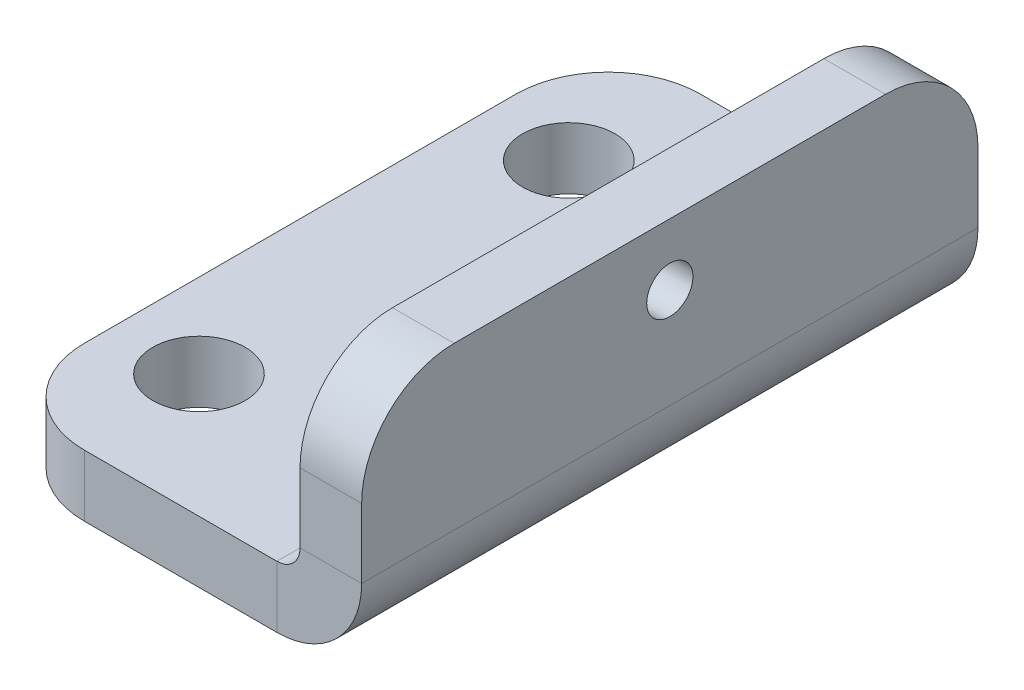
ISO-10303-21;
HEADER;
FILE_DESCRIPTION(('STEP AP214'),'2;1');
FILE_NAME('part.step','',(''),(''),'','','');
FILE_SCHEMA(('AUTOMOTIVE_DESIGN { 1 0 10303 214 1 1 1 1 }'));
ENDSEC;
DATA;
#1=APPLICATION_CONTEXT('core data for automotive mechanical design processes');
#2=APPLICATION_PROTOCOL_DEFINITION('international standard','automotive_design',2000,#1);
#3=PRODUCT_CONTEXT('',#1,'mechanical');
#4=PRODUCT('Part','Part','',(#3));
#5=PRODUCT_RELATED_PRODUCT_CATEGORY('part','',(#4));
#6=PRODUCT_DEFINITION_FORMATION('','',#4);
#7=PRODUCT_DEFINITION_CONTEXT('part definition',#1,'design');
#8=PRODUCT_DEFINITION('design','',#6,#7);
#9=PRODUCT_DEFINITION_SHAPE('','',#8);
#10=(LENGTH_UNIT() NAMED_UNIT(*) SI_UNIT(.MILLI.,.METRE.));
#11=(NAMED_UNIT(*) PLANE_ANGLE_UNIT() SI_UNIT($,.RADIAN.));
#12=(NAMED_UNIT(*) SI_UNIT($,.STERADIAN.) SOLID_ANGLE_UNIT());
#13=UNCERTAINTY_MEASURE_WITH_UNIT(LENGTH_MEASURE(1.E-05),#10,'distance_accuracy_value','');
#14=(GEOMETRIC_REPRESENTATION_CONTEXT(3) GLOBAL_UNCERTAINTY_ASSIGNED_CONTEXT((#13)) GLOBAL_UNIT_ASSIGNED_CONTEXT((#10,
#11,#12)) REPRESENTATION_CONTEXT('',''));
#15=CARTESIAN_POINT('',(0.,0.,0.));
#16=DIRECTION('',(0.,0.,1.));
#17=DIRECTION('',(1.,0.,0.));
#18=AXIS2_PLACEMENT_3D('',#15,#16,#17);
#19=CARTESIAN_POINT('',(-2.75,0.,10.));
#20=DIRECTION('',(0.,0.,1.));
#21=DIRECTION('',(1.,0.,0.));
#22=AXIS2_PLACEMENT_3D('',#19,#20,#21);
#23=PLANE('',#22);
#24=DIRECTION('',(0.,1.,0.));
#25=VECTOR('',#24,1.);
#26=CARTESIAN_POINT('',(-2.75,0.,10.));
#27=LINE('',#26,#25);
#28=CARTESIAN_POINT('',(-2.75,0.,10.));
#29=VERTEX_POINT('',#28);
#30=CARTESIAN_POINT('',(-2.75,2.,10.));
#31=VERTEX_POINT('',#30);
#32=EDGE_CURVE('E125',#29,#31,#27,.T.);
#33=ORIENTED_EDGE('',*,*,#32,.F.);
#34=CARTESIAN_POINT('',(-2.75,2.75,10.));
#35=DIRECTION('',(0.,0.,1.));
#36=DIRECTION('',(1.,0.,0.));
#37=AXIS2_PLACEMENT_3D('',#34,#35,#36);
#38=CIRCLE('',#37,2.75);
#39=CARTESIAN_POINT('',(0.,2.75,10.));
#40=VERTEX_POINT('',#39);
#41=EDGE_CURVE('E129',#40,#29,#38,.F.);
#42=ORIENTED_EDGE('',*,*,#41,.F.);
#43=DIRECTION('',(1.,0.,0.));
#44=VECTOR('',#43,1.);
#45=CARTESIAN_POINT('',(-2.,2.75,10.));
#46=LINE('',#45,#44);
#47=CARTESIAN_POINT('',(-2.,2.75,10.));
#48=VERTEX_POINT('',#47);
#49=EDGE_CURVE('E134',#48,#40,#46,.T.);
#50=ORIENTED_EDGE('',*,*,#49,.F.);
#51=CARTESIAN_POINT('',(-2.75,2.75,10.));
#52=DIRECTION('',(0.,0.,1.));
#53=DIRECTION('',(1.,0.,0.));
#54=AXIS2_PLACEMENT_3D('',#51,#52,#53);
#55=CIRCLE('',#54,0.75);
#56=EDGE_CURVE('E131',#48,#31,#55,.F.);
#57=ORIENTED_EDGE('',*,*,#56,.T.);
#58=EDGE_LOOP('',(#33,#42,#50,#57));
#59=FACE_BOUND('',#58,.T.);
#60=ADVANCED_FACE('F34',(#59),#23,.T.);
#61=CARTESIAN_POINT('',(-2.,2.75,10.));
#62=DIRECTION('',(0.,0.,1.));
#63=DIRECTION('',(1.,0.,0.));
#64=AXIS2_PLACEMENT_3D('',#61,#62,#63);
#65=PLANE('',#64);
#66=DIRECTION('',(-1.,0.,0.));
#67=VECTOR('',#66,1.);
#68=CARTESIAN_POINT('',(0.,2.,10.));
#69=LINE('',#68,#67);
#70=CARTESIAN_POINT('',(-9.,2.,10.));
#71=VERTEX_POINT('',#70);
#72=EDGE_CURVE('E152',#31,#71,#69,.T.);
#73=ORIENTED_EDGE('',*,*,#72,.T.);
#74=DIRECTION('',(0.,1.,0.));
#75=VECTOR('',#74,1.);
#76=CARTESIAN_POINT('',(-9.,2.75,10.));
#77=LINE('',#76,#75);
#78=CARTESIAN_POINT('',(-9.,0.,10.));
#79=VERTEX_POINT('',#78);
#80=EDGE_CURVE('E42',#71,#79,#77,.F.);
#81=ORIENTED_EDGE('',*,*,#80,.T.);
#82=DIRECTION('',(-1.,0.,0.));
#83=VECTOR('',#82,1.);
#84=CARTESIAN_POINT('',(0.,0.,10.));
#85=LINE('',#84,#83);
#86=EDGE_CURVE('E141',#29,#79,#85,.T.);
#87=ORIENTED_EDGE('',*,*,#86,.F.);
#88=ORIENTED_EDGE('',*,*,#32,.T.);
#89=EDGE_LOOP('',(#73,#81,#87,#88));
#90=FACE_BOUND('',#89,.T.);
#91=ADVANCED_FACE('F151',(#90),#65,.T.);
#92=CARTESIAN_POINT('',(0.,2.75,-10.));
#93=DIRECTION('',(0.,0.,-1.));
#94=DIRECTION('',(-1.,0.,0.));
#95=AXIS2_PLACEMENT_3D('',#92,#93,#94);
#96=PLANE('',#95);
#97=DIRECTION('',(-1.,0.,0.));
#98=VECTOR('',#97,1.);
#99=CARTESIAN_POINT('',(0.,2.75,-10.));
#100=LINE('',#99,#98);
#101=CARTESIAN_POINT('',(0.,2.75,-10.));
#102=VERTEX_POINT('',#101);
#103=CARTESIAN_POINT('',(-2.,2.75,-10.));
#104=VERTEX_POINT('',#103);
#105=EDGE_CURVE('E197',#102,#104,#100,.T.);
#106=ORIENTED_EDGE('',*,*,#105,.F.);
#107=CARTESIAN_POINT('',(-2.75,2.75,-10.));
#108=DIRECTION('',(0.,0.,1.));
#109=DIRECTION('',(1.,0.,0.));
#110=AXIS2_PLACEMENT_3D('',#107,#108,#109);
#111=CIRCLE('',#110,2.75);
#112=CARTESIAN_POINT('',(-2.75,0.,-10.));
#113=VERTEX_POINT('',#112);
#114=EDGE_CURVE('E171',#102,#113,#111,.F.);
#115=ORIENTED_EDGE('',*,*,#114,.T.);
#116=DIRECTION('',(0.,-1.,0.));
#117=VECTOR('',#116,1.);
#118=CARTESIAN_POINT('',(-2.75,2.,-10.));
#119=LINE('',#118,#117);
#120=CARTESIAN_POINT('',(-2.75,2.,-10.));
#121=VERTEX_POINT('',#120);
#122=EDGE_CURVE('E195',#121,#113,#119,.T.);
#123=ORIENTED_EDGE('',*,*,#122,.F.);
#124=CARTESIAN_POINT('',(-2.75,2.75,-10.));
#125=DIRECTION('',(0.,0.,1.));
#126=DIRECTION('',(1.,0.,0.));
#127=AXIS2_PLACEMENT_3D('',#124,#125,#126);
#128=CIRCLE('',#127,0.75);
#129=EDGE_CURVE('E177',#104,#121,#128,.F.);
#130=ORIENTED_EDGE('',*,*,#129,.F.);
#131=EDGE_LOOP('',(#106,#115,#123,#130));
#132=FACE_BOUND('',#131,.T.);
#133=ADVANCED_FACE('F299',(#132),#96,.T.);
#134=CARTESIAN_POINT('',(-2.75,2.,-10.));
#135=DIRECTION('',(0.,0.,-1.));
#136=DIRECTION('',(-1.,0.,0.));
#137=AXIS2_PLACEMENT_3D('',#134,#135,#136);
#138=PLANE('',#137);
#139=DIRECTION('',(0.,1.,0.));
#140=VECTOR('',#139,1.);
#141=CARTESIAN_POINT('',(-2.,8.,-10.));
#142=LINE('',#141,#140);
#143=CARTESIAN_POINT('',(-2.,5.,-10.));
#144=VERTEX_POINT('',#143);
#145=EDGE_CURVE('E175',#144,#104,#142,.F.);
#146=ORIENTED_EDGE('',*,*,#145,.F.);
#147=DIRECTION('',(1.,0.,0.));
#148=VECTOR('',#147,1.);
#149=CARTESIAN_POINT('',(-2.75,5.,-10.));
#150=LINE('',#149,#148);
#151=CARTESIAN_POINT('',(0.,5.,-10.));
#152=VERTEX_POINT('',#151);
#153=EDGE_CURVE('E133',#144,#152,#150,.T.);
#154=ORIENTED_EDGE('',*,*,#153,.T.);
#155=DIRECTION('',(0.,-1.,0.));
#156=VECTOR('',#155,1.);
#157=CARTESIAN_POINT('',(0.,8.,-10.));
#158=LINE('',#157,#156);
#159=EDGE_CURVE('E173',#152,#102,#158,.T.);
#160=ORIENTED_EDGE('',*,*,#159,.T.);
#161=ORIENTED_EDGE('',*,*,#105,.T.);
#162=EDGE_LOOP('',(#146,#154,#160,#161));
#163=FACE_BOUND('',#162,.T.);
#164=ADVANCED_FACE('F294',(#163),#138,.T.);
#165=CARTESIAN_POINT('',(0.,2.,10.));
#166=DIRECTION('',(0.,-1.,0.));
#167=DIRECTION('',(1.,0.,0.));
#168=AXIS2_PLACEMENT_3D('',#165,#166,#167);
#169=PLANE('',#168);
#170=CARTESIAN_POINT('',(-9.27896890843565,2.,6.));
#171=DIRECTION('',(0.,1.,0.));
#172=DIRECTION('',(1.,0.,0.));
#173=AXIS2_PLACEMENT_3D('',#170,#171,#172);
#174=CIRCLE('',#173,1.5);
#175=CARTESIAN_POINT('',(-7.77896890843565,2.,6.));
#176=VERTEX_POINT('',#175);
#177=EDGE_CURVE('E253',#176,#176,#174,.T.);
#178=ORIENTED_EDGE('',*,*,#177,.F.);
#179=EDGE_LOOP('',(#178));
#180=FACE_BOUND('',#179,.T.);
#181=CARTESIAN_POINT('',(-9.27896890843565,2.,-6.));
#182=DIRECTION('',(0.,1.,0.));
#183=DIRECTION('',(-1.,0.,0.));
#184=AXIS2_PLACEMENT_3D('',#181,#182,#183);
#185=CIRCLE('',#184,1.5);
#186=CARTESIAN_POINT('',(-10.7789689084356,2.,-6.));
#187=VERTEX_POINT('',#186);
#188=EDGE_CURVE('E247',#187,#187,#185,.T.);
#189=ORIENTED_EDGE('',*,*,#188,.F.);
#190=EDGE_LOOP('',(#189));
#191=FACE_BOUND('',#190,.T.);
#192=DIRECTION('',(-1.,0.,0.));
#193=VECTOR('',#192,1.);
#194=CARTESIAN_POINT('',(0.,2.,-10.));
#195=LINE('',#194,#193);
#196=CARTESIAN_POINT('',(-9.,2.,-10.));
#197=VERTEX_POINT('',#196);
#198=EDGE_CURVE('E166',#121,#197,#195,.T.);
#199=ORIENTED_EDGE('',*,*,#198,.T.);
#200=CARTESIAN_POINT('',(-9.,2.,-7.));
#201=DIRECTION('',(0.,-1.,0.));
#202=DIRECTION('',(1.,0.,0.));
#203=AXIS2_PLACEMENT_3D('',#200,#201,#202);
#204=CIRCLE('',#203,3.);
#205=CARTESIAN_POINT('',(-12.,2.,-7.));
#206=VERTEX_POINT('',#205);
#207=EDGE_CURVE('E222',#197,#206,#204,.F.);
#208=ORIENTED_EDGE('',*,*,#207,.T.);
#209=DIRECTION('',(0.,0.,-1.));
#210=VECTOR('',#209,1.);
#211=CARTESIAN_POINT('',(-12.,2.,10.));
#212=LINE('',#211,#210);
#213=CARTESIAN_POINT('',(-12.,2.,7.));
#214=VERTEX_POINT('',#213);
#215=EDGE_CURVE('E193',#214,#206,#212,.T.);
#216=ORIENTED_EDGE('',*,*,#215,.F.);
#217=CARTESIAN_POINT('',(-9.,2.,7.));
#218=DIRECTION('',(0.,-1.,0.));
#219=DIRECTION('',(1.,0.,0.));
#220=AXIS2_PLACEMENT_3D('',#217,#218,#219);
#221=CIRCLE('',#220,3.);
#222=EDGE_CURVE('E220',#214,#71,#221,.F.);
#223=ORIENTED_EDGE('',*,*,#222,.T.);
#224=ORIENTED_EDGE('',*,*,#72,.F.);
#225=DIRECTION('',(0.,0.,-1.));
#226=VECTOR('',#225,1.);
#227=CARTESIAN_POINT('',(-2.75,2.,10.));
#228=LINE('',#227,#226);
#229=EDGE_CURVE('E165',#31,#121,#228,.T.);
#230=ORIENTED_EDGE('',*,*,#229,.T.);
#231=EDGE_LOOP('',(#199,#208,#216,#223,#224,#230));
#232=FACE_BOUND('',#231,.T.);
#233=ADVANCED_FACE('F240',(#180,#191,#232),#169,.F.);
#234=CARTESIAN_POINT('',(-12.,0.,10.));
#235=DIRECTION('',(-1.,0.,0.));
#236=DIRECTION('',(0.,0.,1.));
#237=AXIS2_PLACEMENT_3D('',#234,#235,#236);
#238=PLANE('',#237);
#239=ORIENTED_EDGE('',*,*,#215,.T.);
#240=DIRECTION('',(0.,1.,0.));
#241=VECTOR('',#240,1.);
#242=CARTESIAN_POINT('',(-12.,0.,-7.));
#243=LINE('',#242,#241);
#244=CARTESIAN_POINT('',(-12.,0.,-7.));
#245=VERTEX_POINT('',#244);
#246=EDGE_CURVE('E56',#206,#245,#243,.F.);
#247=ORIENTED_EDGE('',*,*,#246,.T.);
#248=DIRECTION('',(0.,0.,-1.));
#249=VECTOR('',#248,1.);
#250=CARTESIAN_POINT('',(-12.,0.,10.));
#251=LINE('',#250,#249);
#252=CARTESIAN_POINT('',(-12.,0.,7.));
#253=VERTEX_POINT('',#252);
#254=EDGE_CURVE('E148',#253,#245,#251,.T.);
#255=ORIENTED_EDGE('',*,*,#254,.F.);
#256=DIRECTION('',(0.,1.,0.));
#257=VECTOR('',#256,1.);
#258=CARTESIAN_POINT('',(-12.,0.,7.));
#259=LINE('',#258,#257);
#260=EDGE_CURVE('E224',#253,#214,#259,.T.);
#261=ORIENTED_EDGE('',*,*,#260,.T.);
#262=EDGE_LOOP('',(#239,#247,#255,#261));
#263=FACE_BOUND('',#262,.T.);
#264=ADVANCED_FACE('F241',(#263),#238,.T.);
#265=CARTESIAN_POINT('',(0.,0.,10.));
#266=DIRECTION('',(0.,-1.,0.));
#267=DIRECTION('',(1.,0.,0.));
#268=AXIS2_PLACEMENT_3D('',#265,#266,#267);
#269=PLANE('',#268);
#270=CARTESIAN_POINT('',(-9.27896890843565,0.,6.));
#271=DIRECTION('',(0.,1.,0.));
#272=DIRECTION('',(1.,0.,0.));
#273=AXIS2_PLACEMENT_3D('',#270,#271,#272);
#274=CIRCLE('',#273,1.5);
#275=CARTESIAN_POINT('',(-7.77896890843565,0.,6.));
#276=VERTEX_POINT('',#275);
#277=EDGE_CURVE('E250',#276,#276,#274,.T.);
#278=ORIENTED_EDGE('',*,*,#277,.T.);
#279=EDGE_LOOP('',(#278));
#280=FACE_BOUND('',#279,.T.);
#281=CARTESIAN_POINT('',(-9.27896890843565,0.,-6.));
#282=DIRECTION('',(0.,1.,0.));
#283=DIRECTION('',(-1.,0.,0.));
#284=AXIS2_PLACEMENT_3D('',#281,#282,#283);
#285=CIRCLE('',#284,1.5);
#286=CARTESIAN_POINT('',(-10.7789689084356,0.,-6.));
#287=VERTEX_POINT('',#286);
#288=EDGE_CURVE('E169',#287,#287,#285,.T.);
#289=ORIENTED_EDGE('',*,*,#288,.T.);
#290=EDGE_LOOP('',(#289));
#291=FACE_BOUND('',#290,.T.);
#292=ORIENTED_EDGE('',*,*,#254,.T.);
#293=CARTESIAN_POINT('',(-9.,0.,-7.));
#294=DIRECTION('',(0.,-1.,0.));
#295=DIRECTION('',(1.,0.,0.));
#296=AXIS2_PLACEMENT_3D('',#293,#294,#295);
#297=CIRCLE('',#296,3.);
#298=CARTESIAN_POINT('',(-9.,0.,-10.));
#299=VERTEX_POINT('',#298);
#300=EDGE_CURVE('E230',#245,#299,#297,.T.);
#301=ORIENTED_EDGE('',*,*,#300,.T.);
#302=DIRECTION('',(-1.,0.,0.));
#303=VECTOR('',#302,1.);
#304=CARTESIAN_POINT('',(0.,0.,-10.));
#305=LINE('',#304,#303);
#306=EDGE_CURVE('E144',#113,#299,#305,.T.);
#307=ORIENTED_EDGE('',*,*,#306,.F.);
#308=DIRECTION('',(0.,0.,-1.));
#309=VECTOR('',#308,1.);
#310=CARTESIAN_POINT('',(-2.75,0.,10.));
#311=LINE('',#310,#309);
#312=EDGE_CURVE('E139',#29,#113,#311,.T.);
#313=ORIENTED_EDGE('',*,*,#312,.F.);
#314=ORIENTED_EDGE('',*,*,#86,.T.);
#315=CARTESIAN_POINT('',(-9.,0.,7.));
#316=DIRECTION('',(0.,-1.,0.));
#317=DIRECTION('',(1.,0.,0.));
#318=AXIS2_PLACEMENT_3D('',#315,#316,#317);
#319=CIRCLE('',#318,3.);
#320=EDGE_CURVE('E228',#79,#253,#319,.T.);
#321=ORIENTED_EDGE('',*,*,#320,.T.);
#322=EDGE_LOOP('',(#292,#301,#307,#313,#314,#321));
#323=FACE_BOUND('',#322,.T.);
#324=ADVANCED_FACE('F140',(#280,#291,#323),#269,.T.);
#325=CARTESIAN_POINT('',(-2.75,2.75,10.));
#326=DIRECTION('',(0.,0.,-1.));
#327=DIRECTION('',(-1.,0.,0.));
#328=AXIS2_PLACEMENT_3D('',#325,#326,#327);
#329=CYLINDRICAL_SURFACE('',#328,2.75);
#330=ORIENTED_EDGE('',*,*,#114,.F.);
#331=DIRECTION('',(0.,0.,-1.));
#332=VECTOR('',#331,1.);
#333=CARTESIAN_POINT('',(0.,2.75,10.));
#334=LINE('',#333,#332);
#335=EDGE_CURVE('E149',#40,#102,#334,.T.);
#336=ORIENTED_EDGE('',*,*,#335,.F.);
#337=ORIENTED_EDGE('',*,*,#41,.T.);
#338=ORIENTED_EDGE('',*,*,#312,.T.);
#339=EDGE_LOOP('',(#330,#336,#337,#338));
#340=FACE_BOUND('',#339,.T.);
#341=ADVANCED_FACE('F155',(#340),#329,.T.);
#342=CARTESIAN_POINT('',(0.,8.,10.));
#343=DIRECTION('',(1.,0.,0.));
#344=DIRECTION('',(0.,0.,-1.));
#345=AXIS2_PLACEMENT_3D('',#342,#343,#344);
#346=PLANE('',#345);
#347=CARTESIAN_POINT('',(0.,6.,0.));
#348=DIRECTION('',(-1.,0.,0.));
#349=DIRECTION('',(0.,0.,1.));
#350=AXIS2_PLACEMENT_3D('',#347,#348,#349);
#351=CIRCLE('',#350,0.75);
#352=CARTESIAN_POINT('',(0.,6.,0.75));
#353=VERTEX_POINT('',#352);
#354=EDGE_CURVE('E256',#353,#353,#351,.T.);
#355=ORIENTED_EDGE('',*,*,#354,.T.);
#356=EDGE_LOOP('',(#355));
#357=FACE_BOUND('',#356,.T.);
#358=ORIENTED_EDGE('',*,*,#159,.F.);
#359=CARTESIAN_POINT('',(0.,5.,-7.));
#360=DIRECTION('',(1.,0.,0.));
#361=DIRECTION('',(0.,0.,-1.));
#362=AXIS2_PLACEMENT_3D('',#359,#360,#361);
#363=CIRCLE('',#362,3.);
#364=CARTESIAN_POINT('',(0.,8.,-7.));
#365=VERTEX_POINT('',#364);
#366=EDGE_CURVE('E206',#152,#365,#363,.T.);
#367=ORIENTED_EDGE('',*,*,#366,.T.);
#368=DIRECTION('',(0.,0.,-1.));
#369=VECTOR('',#368,1.);
#370=CARTESIAN_POINT('',(0.,8.,10.));
#371=LINE('',#370,#369);
#372=CARTESIAN_POINT('',(0.,8.,7.));
#373=VERTEX_POINT('',#372);
#374=EDGE_CURVE('E188',#373,#365,#371,.T.);
#375=ORIENTED_EDGE('',*,*,#374,.F.);
#376=CARTESIAN_POINT('',(0.,5.,7.));
#377=DIRECTION('',(1.,0.,0.));
#378=DIRECTION('',(0.,0.,-1.));
#379=AXIS2_PLACEMENT_3D('',#376,#377,#378);
#380=CIRCLE('',#379,3.);
#381=CARTESIAN_POINT('',(0.,5.,10.));
#382=VERTEX_POINT('',#381);
#383=EDGE_CURVE('E204',#373,#382,#380,.T.);
#384=ORIENTED_EDGE('',*,*,#383,.T.);
#385=DIRECTION('',(0.,-1.,0.));
#386=VECTOR('',#385,1.);
#387=CARTESIAN_POINT('',(0.,8.,10.));
#388=LINE('',#387,#386);
#389=EDGE_CURVE('E157',#382,#40,#388,.T.);
#390=ORIENTED_EDGE('',*,*,#389,.T.);
#391=ORIENTED_EDGE('',*,*,#335,.T.);
#392=EDGE_LOOP('',(#358,#367,#375,#384,#390,#391));
#393=FACE_BOUND('',#392,.T.);
#394=ADVANCED_FACE('F265',(#357,#393),#346,.T.);
#395=CARTESIAN_POINT('',(-2.,8.,10.));
#396=DIRECTION('',(0.,1.,0.));
#397=DIRECTION('',(0.,0.,1.));
#398=AXIS2_PLACEMENT_3D('',#395,#396,#397);
#399=PLANE('',#398);
#400=ORIENTED_EDGE('',*,*,#374,.T.);
#401=DIRECTION('',(1.,0.,0.));
#402=VECTOR('',#401,1.);
#403=CARTESIAN_POINT('',(-2.,8.,-7.));
#404=LINE('',#403,#402);
#405=CARTESIAN_POINT('',(-2.,8.,-7.));
#406=VERTEX_POINT('',#405);
#407=EDGE_CURVE('E211',#365,#406,#404,.F.);
#408=ORIENTED_EDGE('',*,*,#407,.T.);
#409=DIRECTION('',(0.,0.,-1.));
#410=VECTOR('',#409,1.);
#411=CARTESIAN_POINT('',(-2.,8.,10.));
#412=LINE('',#411,#410);
#413=CARTESIAN_POINT('',(-2.,8.,7.));
#414=VERTEX_POINT('',#413);
#415=EDGE_CURVE('E185',#414,#406,#412,.T.);
#416=ORIENTED_EDGE('',*,*,#415,.F.);
#417=DIRECTION('',(1.,0.,0.));
#418=VECTOR('',#417,1.);
#419=CARTESIAN_POINT('',(-2.,8.,7.));
#420=LINE('',#419,#418);
#421=EDGE_CURVE('E208',#414,#373,#420,.T.);
#422=ORIENTED_EDGE('',*,*,#421,.T.);
#423=EDGE_LOOP('',(#400,#408,#416,#422));
#424=FACE_BOUND('',#423,.T.);
#425=ADVANCED_FACE('F279',(#424),#399,.T.);
#426=CARTESIAN_POINT('',(-2.,8.,10.));
#427=DIRECTION('',(1.,0.,0.));
#428=DIRECTION('',(0.,0.,-1.));
#429=AXIS2_PLACEMENT_3D('',#426,#427,#428);
#430=PLANE('',#429);
#431=CARTESIAN_POINT('',(-2.,6.,0.));
#432=DIRECTION('',(-1.,0.,0.));
#433=DIRECTION('',(0.,0.,1.));
#434=AXIS2_PLACEMENT_3D('',#431,#432,#433);
#435=CIRCLE('',#434,0.75);
#436=CARTESIAN_POINT('',(-2.,6.,0.75));
#437=VERTEX_POINT('',#436);
#438=EDGE_CURVE('E259',#437,#437,#435,.T.);
#439=ORIENTED_EDGE('',*,*,#438,.F.);
#440=EDGE_LOOP('',(#439));
#441=FACE_BOUND('',#440,.T.);
#442=ORIENTED_EDGE('',*,*,#415,.T.);
#443=CARTESIAN_POINT('',(-2.,5.,-7.));
#444=DIRECTION('',(1.,0.,0.));
#445=DIRECTION('',(0.,0.,-1.));
#446=AXIS2_PLACEMENT_3D('',#443,#444,#445);
#447=CIRCLE('',#446,3.);
#448=EDGE_CURVE('E215',#406,#144,#447,.F.);
#449=ORIENTED_EDGE('',*,*,#448,.T.);
#450=ORIENTED_EDGE('',*,*,#145,.T.);
#451=DIRECTION('',(0.,0.,-1.));
#452=VECTOR('',#451,1.);
#453=CARTESIAN_POINT('',(-2.,2.75,10.));
#454=LINE('',#453,#452);
#455=EDGE_CURVE('E182',#48,#104,#454,.T.);
#456=ORIENTED_EDGE('',*,*,#455,.F.);
#457=DIRECTION('',(0.,1.,0.));
#458=VECTOR('',#457,1.);
#459=CARTESIAN_POINT('',(-2.,8.,10.));
#460=LINE('',#459,#458);
#461=CARTESIAN_POINT('',(-2.,5.,10.));
#462=VERTEX_POINT('',#461);
#463=EDGE_CURVE('E159',#462,#48,#460,.F.);
#464=ORIENTED_EDGE('',*,*,#463,.F.);
#465=CARTESIAN_POINT('',(-2.,5.,7.));
#466=DIRECTION('',(1.,0.,0.));
#467=DIRECTION('',(0.,0.,-1.));
#468=AXIS2_PLACEMENT_3D('',#465,#466,#467);
#469=CIRCLE('',#468,3.);
#470=EDGE_CURVE('E213',#462,#414,#469,.F.);
#471=ORIENTED_EDGE('',*,*,#470,.T.);
#472=EDGE_LOOP('',(#442,#449,#450,#456,#464,#471));
#473=FACE_BOUND('',#472,.T.);
#474=ADVANCED_FACE('F275',(#441,#473),#430,.F.);
#475=CARTESIAN_POINT('',(-2.75,2.75,10.));
#476=DIRECTION('',(0.,0.,-1.));
#477=DIRECTION('',(-1.,0.,0.));
#478=AXIS2_PLACEMENT_3D('',#475,#476,#477);
#479=CYLINDRICAL_SURFACE('',#478,0.75);
#480=ORIENTED_EDGE('',*,*,#129,.T.);
#481=ORIENTED_EDGE('',*,*,#229,.F.);
#482=ORIENTED_EDGE('',*,*,#56,.F.);
#483=ORIENTED_EDGE('',*,*,#455,.T.);
#484=EDGE_LOOP('',(#480,#481,#482,#483));
#485=FACE_BOUND('',#484,.T.);
#486=ADVANCED_FACE('F278',(#485),#479,.F.);
#487=CARTESIAN_POINT('',(-2.75,2.75,10.));
#488=DIRECTION('',(0.,0.,1.));
#489=DIRECTION('',(1.,0.,0.));
#490=AXIS2_PLACEMENT_3D('',#487,#488,#489);
#491=PLANE('',#490);
#492=ORIENTED_EDGE('',*,*,#389,.F.);
#493=DIRECTION('',(1.,0.,0.));
#494=VECTOR('',#493,1.);
#495=CARTESIAN_POINT('',(-2.75,5.,10.));
#496=LINE('',#495,#494);
#497=EDGE_CURVE('E11',#382,#462,#496,.F.);
#498=ORIENTED_EDGE('',*,*,#497,.T.);
#499=ORIENTED_EDGE('',*,*,#463,.T.);
#500=ORIENTED_EDGE('',*,*,#49,.T.);
#501=EDGE_LOOP('',(#492,#498,#499,#500));
#502=FACE_BOUND('',#501,.T.);
#503=ADVANCED_FACE('F306',(#502),#491,.T.);
#504=CARTESIAN_POINT('',(-2.75,2.75,-10.));
#505=DIRECTION('',(0.,0.,1.));
#506=DIRECTION('',(1.,0.,0.));
#507=AXIS2_PLACEMENT_3D('',#504,#505,#506);
#508=PLANE('',#507);
#509=ORIENTED_EDGE('',*,*,#306,.T.);
#510=DIRECTION('',(0.,1.,0.));
#511=VECTOR('',#510,1.);
#512=CARTESIAN_POINT('',(-9.,2.,-10.));
#513=LINE('',#512,#511);
#514=EDGE_CURVE('E217',#299,#197,#513,.T.);
#515=ORIENTED_EDGE('',*,*,#514,.T.);
#516=ORIENTED_EDGE('',*,*,#198,.F.);
#517=ORIENTED_EDGE('',*,*,#122,.T.);
#518=EDGE_LOOP('',(#509,#515,#516,#517));
#519=FACE_BOUND('',#518,.T.);
#520=ADVANCED_FACE('F235',(#519),#508,.F.);
#521=CARTESIAN_POINT('',(-2.75,5.,-7.));
#522=DIRECTION('',(1.,0.,0.));
#523=DIRECTION('',(0.,0.,-1.));
#524=AXIS2_PLACEMENT_3D('',#521,#522,#523);
#525=CYLINDRICAL_SURFACE('',#524,3.);
#526=ORIENTED_EDGE('',*,*,#448,.F.);
#527=ORIENTED_EDGE('',*,*,#407,.F.);
#528=ORIENTED_EDGE('',*,*,#366,.F.);
#529=ORIENTED_EDGE('',*,*,#153,.F.);
#530=EDGE_LOOP('',(#526,#527,#528,#529));
#531=FACE_BOUND('',#530,.T.);
#532=ADVANCED_FACE('F291',(#531),#525,.T.);
#533=CARTESIAN_POINT('',(-9.,2.75,-7.));
#534=DIRECTION('',(0.,-1.,0.));
#535=DIRECTION('',(0.,0.,-1.));
#536=AXIS2_PLACEMENT_3D('',#533,#534,#535);
#537=CYLINDRICAL_SURFACE('',#536,3.);
#538=ORIENTED_EDGE('',*,*,#300,.F.);
#539=ORIENTED_EDGE('',*,*,#246,.F.);
#540=ORIENTED_EDGE('',*,*,#207,.F.);
#541=ORIENTED_EDGE('',*,*,#514,.F.);
#542=EDGE_LOOP('',(#538,#539,#540,#541));
#543=FACE_BOUND('',#542,.T.);
#544=ADVANCED_FACE('F237',(#543),#537,.T.);
#545=CARTESIAN_POINT('',(-9.,0.,7.));
#546=DIRECTION('',(0.,1.,0.));
#547=DIRECTION('',(0.,0.,1.));
#548=AXIS2_PLACEMENT_3D('',#545,#546,#547);
#549=CYLINDRICAL_SURFACE('',#548,3.);
#550=ORIENTED_EDGE('',*,*,#320,.F.);
#551=ORIENTED_EDGE('',*,*,#80,.F.);
#552=ORIENTED_EDGE('',*,*,#222,.F.);
#553=ORIENTED_EDGE('',*,*,#260,.F.);
#554=EDGE_LOOP('',(#550,#551,#552,#553));
#555=FACE_BOUND('',#554,.T.);
#556=ADVANCED_FACE('F244',(#555),#549,.T.);
#557=CARTESIAN_POINT('',(-2.,5.,7.));
#558=DIRECTION('',(1.,0.,0.));
#559=DIRECTION('',(0.,0.,-1.));
#560=AXIS2_PLACEMENT_3D('',#557,#558,#559);
#561=CYLINDRICAL_SURFACE('',#560,3.);
#562=ORIENTED_EDGE('',*,*,#470,.F.);
#563=ORIENTED_EDGE('',*,*,#497,.F.);
#564=ORIENTED_EDGE('',*,*,#383,.F.);
#565=ORIENTED_EDGE('',*,*,#421,.F.);
#566=EDGE_LOOP('',(#562,#563,#564,#565));
#567=FACE_BOUND('',#566,.T.);
#568=ADVANCED_FACE('F36',(#567),#561,.T.);
#569=CARTESIAN_POINT('',(-9.27896890843565,0.,-6.));
#570=DIRECTION('',(0.,1.,0.));
#571=DIRECTION('',(-1.,0.,0.));
#572=AXIS2_PLACEMENT_3D('',#569,#570,#571);
#573=CYLINDRICAL_SURFACE('',#572,1.5);
#574=ORIENTED_EDGE('',*,*,#288,.F.);
#575=EDGE_LOOP('',(#574));
#576=FACE_BOUND('',#575,.T.);
#577=ORIENTED_EDGE('',*,*,#188,.T.);
#578=EDGE_LOOP('',(#577));
#579=FACE_BOUND('',#578,.T.);
#580=ADVANCED_FACE('F331',(#576,#579),#573,.F.);
#581=CARTESIAN_POINT('',(-9.27896890843565,0.,6.));
#582=DIRECTION('',(0.,1.,0.));
#583=DIRECTION('',(-1.,0.,0.));
#584=AXIS2_PLACEMENT_3D('',#581,#582,#583);
#585=CYLINDRICAL_SURFACE('',#584,1.5);
#586=ORIENTED_EDGE('',*,*,#277,.F.);
#587=EDGE_LOOP('',(#586));
#588=FACE_BOUND('',#587,.T.);
#589=ORIENTED_EDGE('',*,*,#177,.T.);
#590=EDGE_LOOP('',(#589));
#591=FACE_BOUND('',#590,.T.);
#592=ADVANCED_FACE('F271',(#588,#591),#585,.F.);
#593=CARTESIAN_POINT('',(0.,6.,0.));
#594=DIRECTION('',(-1.,0.,0.));
#595=DIRECTION('',(0.,0.,1.));
#596=AXIS2_PLACEMENT_3D('',#593,#594,#595);
#597=CYLINDRICAL_SURFACE('',#596,0.75);
#598=ORIENTED_EDGE('',*,*,#354,.F.);
#599=EDGE_LOOP('',(#598));
#600=FACE_BOUND('',#599,.T.);
#601=ORIENTED_EDGE('',*,*,#438,.T.);
#602=EDGE_LOOP('',(#601));
#603=FACE_BOUND('',#602,.T.);
#604=ADVANCED_FACE('F268',(#600,#603),#597,.F.);
#605=CLOSED_SHELL('',(#60,#91,#133,#164,#233,#264,#324,#341,#394,#425,#474,#486,#503,#520,#532,
#544,#556,#568,#580,#592,#604));
#606=MANIFOLD_SOLID_BREP('B2',#605);
#607=ADVANCED_BREP_SHAPE_REPRESENTATION('',(#18,#606),#14);
#608=SHAPE_DEFINITION_REPRESENTATION(#9,#607);
ENDSEC;
END-ISO-10303-21;
